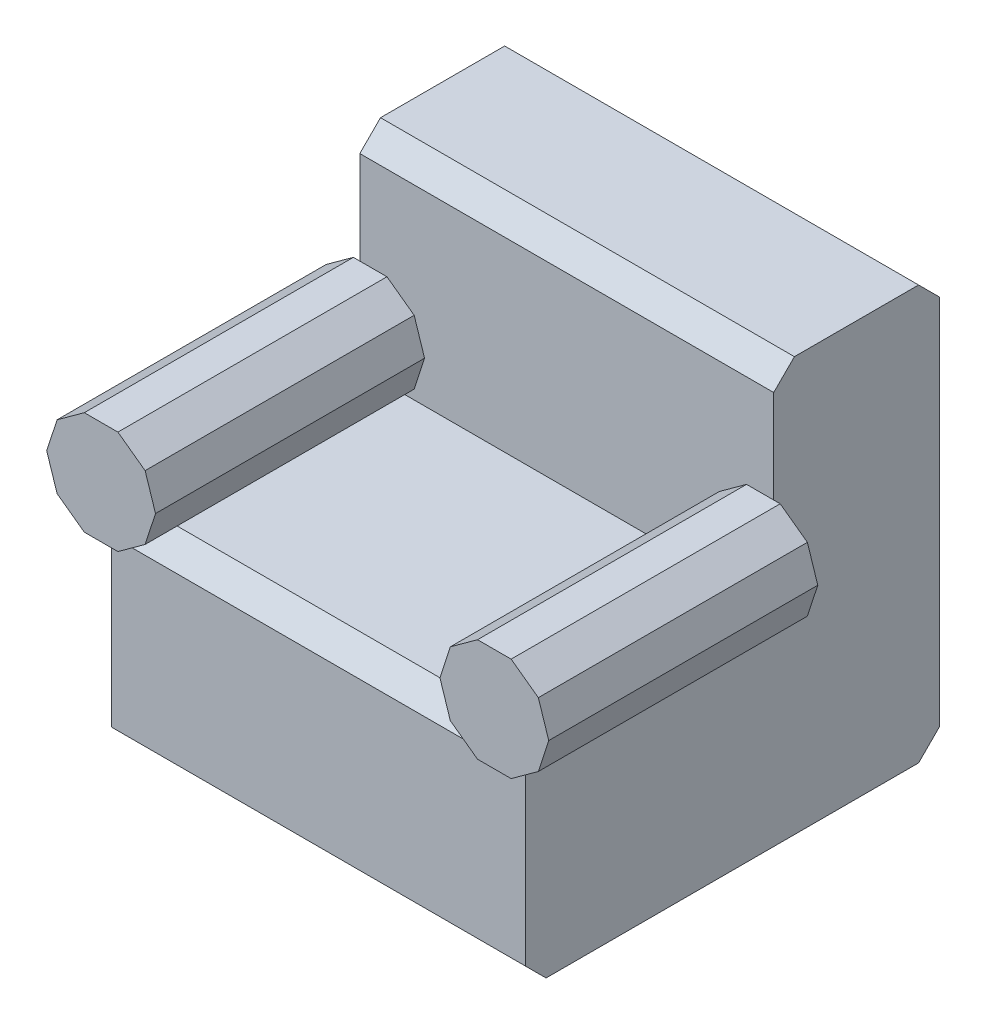
ISO-10303-21;
HEADER;
FILE_DESCRIPTION(('STEP AP214'),'2;1');
FILE_NAME('part.step','',(''),(''),'','','');
FILE_SCHEMA(('AUTOMOTIVE_DESIGN { 1 0 10303 214 1 1 1 1 }'));
ENDSEC;
DATA;
#1=APPLICATION_CONTEXT('core data for automotive mechanical design processes');
#2=APPLICATION_PROTOCOL_DEFINITION('international standard','automotive_design',2000,#1);
#3=PRODUCT_CONTEXT('',#1,'mechanical');
#4=PRODUCT('Part','Part','',(#3));
#5=PRODUCT_RELATED_PRODUCT_CATEGORY('part','',(#4));
#6=PRODUCT_DEFINITION_FORMATION('','',#4);
#7=PRODUCT_DEFINITION_CONTEXT('part definition',#1,'design');
#8=PRODUCT_DEFINITION('design','',#6,#7);
#9=PRODUCT_DEFINITION_SHAPE('','',#8);
#10=(LENGTH_UNIT() NAMED_UNIT(*) SI_UNIT(.MILLI.,.METRE.));
#11=(NAMED_UNIT(*) PLANE_ANGLE_UNIT() SI_UNIT($,.RADIAN.));
#12=(NAMED_UNIT(*) SI_UNIT($,.STERADIAN.) SOLID_ANGLE_UNIT());
#13=UNCERTAINTY_MEASURE_WITH_UNIT(LENGTH_MEASURE(1.E-05),#10,'distance_accuracy_value','');
#14=(GEOMETRIC_REPRESENTATION_CONTEXT(3) GLOBAL_UNCERTAINTY_ASSIGNED_CONTEXT((#13)) GLOBAL_UNIT_ASSIGNED_CONTEXT((#10,
#11,#12)) REPRESENTATION_CONTEXT('',''));
#15=CARTESIAN_POINT('',(0.,0.,0.));
#16=DIRECTION('',(0.,0.,1.));
#17=DIRECTION('',(1.,0.,0.));
#18=AXIS2_PLACEMENT_3D('',#15,#16,#17);
#19=CARTESIAN_POINT('',(50.,45.,0.));
#20=DIRECTION('',(0.,0.,-1.));
#21=DIRECTION('',(0.,1.,0.));
#22=AXIS2_PLACEMENT_3D('',#19,#20,#21);
#23=PLANE('',#22);
#24=DIRECTION('',(0.,-1.,0.));
#25=VECTOR('',#24,1.);
#26=CARTESIAN_POINT('',(-50.,45.,0.));
#27=LINE('',#26,#25);
#28=CARTESIAN_POINT('',(-50.,45.,0.));
#29=VERTEX_POINT('',#28);
#30=CARTESIAN_POINT('',(-50.,22.5,0.));
#31=VERTEX_POINT('',#30);
#32=EDGE_CURVE('E505',#29,#31,#27,.T.);
#33=ORIENTED_EDGE('',*,*,#32,.T.);
#34=DIRECTION('',(1.,0.,0.));
#35=VECTOR('',#34,1.);
#36=CARTESIAN_POINT('',(0.,22.4999999999999,0.));
#37=LINE('',#36,#35);
#38=CARTESIAN_POINT('',(-43.4385037970887,22.5,0.));
#39=VERTEX_POINT('',#38);
#40=EDGE_CURVE('E58',#31,#39,#37,.T.);
#41=ORIENTED_EDGE('',*,*,#40,.T.);
#42=DIRECTION('',(0.809016994374947,-0.587785252292474,0.));
#43=VECTOR('',#42,1.);
#44=CARTESIAN_POINT('',(-4.30824814846336,-5.92979486044836,0.));
#45=LINE('',#44,#43);
#46=CARTESIAN_POINT('',(-36.8668648955995,17.7254248593737,0.));
#47=VERTEX_POINT('',#46);
#48=EDGE_CURVE('E63',#39,#47,#45,.T.);
#49=ORIENTED_EDGE('',*,*,#48,.T.);
#50=DIRECTION('',(0.309016994374946,-0.951056516295154,0.));
#51=VECTOR('',#50,1.);
#52=CARTESIAN_POINT('',(-28.1370209012533,-9.1422722841341,0.));
#53=LINE('',#52,#51);
#54=CARTESIAN_POINT('',(-34.3567221970217,9.99999999999999,0.));
#55=VERTEX_POINT('',#54);
#56=EDGE_CURVE('E669',#47,#55,#53,.T.);
#57=ORIENTED_EDGE('',*,*,#56,.T.);
#58=DIRECTION('',(-0.309016994374949,-0.951056516295153,0.));
#59=VECTOR('',#58,1.);
#60=CARTESIAN_POINT('',(-34.0148734241779,11.0521023403847,0.));
#61=LINE('',#60,#59);
#62=CARTESIAN_POINT('',(-36.8668648955995,2.2745751406263,0.));
#63=VERTEX_POINT('',#62);
#64=EDGE_CURVE('E666',#55,#63,#61,.T.);
#65=ORIENTED_EDGE('',*,*,#64,.T.);
#66=DIRECTION('',(-0.809016994374948,-0.587785252292472,0.));
#67=VECTOR('',#66,1.);
#68=CARTESIAN_POINT('',(-13.8188133114148,19.0199648041978,0.));
#69=LINE('',#68,#67);
#70=CARTESIAN_POINT('',(-39.9975489959107,0.,0.));
#71=VERTEX_POINT('',#70);
#72=EDGE_CURVE('E304',#63,#71,#69,.T.);
#73=ORIENTED_EDGE('',*,*,#72,.T.);
#74=DIRECTION('',(-1.,0.,0.));
#75=VECTOR('',#74,1.);
#76=CARTESIAN_POINT('',(50.,0.,0.));
#77=LINE('',#76,#75);
#78=CARTESIAN_POINT('',(39.9975489959107,0.,0.));
#79=VERTEX_POINT('',#78);
#80=EDGE_CURVE('E574',#79,#71,#77,.T.);
#81=ORIENTED_EDGE('',*,*,#80,.F.);
#82=DIRECTION('',(0.809016994374948,-0.587785252292472,0.));
#83=VECTOR('',#82,1.);
#84=CARTESIAN_POINT('',(13.8188133114148,19.0199648041978,0.));
#85=LINE('',#84,#83);
#86=CARTESIAN_POINT('',(36.8668648955995,2.27457514062629,0.));
#87=VERTEX_POINT('',#86);
#88=EDGE_CURVE('E389',#87,#79,#85,.T.);
#89=ORIENTED_EDGE('',*,*,#88,.F.);
#90=DIRECTION('',(0.309016994374949,-0.951056516295153,0.));
#91=VECTOR('',#90,1.);
#92=CARTESIAN_POINT('',(34.0148734241779,11.0521023403847,0.));
#93=LINE('',#92,#91);
#94=CARTESIAN_POINT('',(34.3567221970217,9.99999999999999,0.));
#95=VERTEX_POINT('',#94);
#96=EDGE_CURVE('E347',#95,#87,#93,.T.);
#97=ORIENTED_EDGE('',*,*,#96,.F.);
#98=DIRECTION('',(-0.309016994374946,-0.951056516295154,0.));
#99=VECTOR('',#98,1.);
#100=CARTESIAN_POINT('',(28.1370209012533,-9.1422722841341,0.));
#101=LINE('',#100,#99);
#102=CARTESIAN_POINT('',(36.8668648955995,17.7254248593737,0.));
#103=VERTEX_POINT('',#102);
#104=EDGE_CURVE('E421',#103,#95,#101,.T.);
#105=ORIENTED_EDGE('',*,*,#104,.F.);
#106=DIRECTION('',(-0.809016994374947,-0.587785252292474,0.));
#107=VECTOR('',#106,1.);
#108=CARTESIAN_POINT('',(4.30824814846336,-5.92979486044836,0.));
#109=LINE('',#108,#107);
#110=CARTESIAN_POINT('',(43.4385037970887,22.5,0.));
#111=VERTEX_POINT('',#110);
#112=EDGE_CURVE('E417',#111,#103,#109,.T.);
#113=ORIENTED_EDGE('',*,*,#112,.F.);
#114=DIRECTION('',(-1.,0.,0.));
#115=VECTOR('',#114,1.);
#116=CARTESIAN_POINT('',(0.,22.4999999999999,0.));
#117=LINE('',#116,#115);
#118=CARTESIAN_POINT('',(50.,22.5,0.));
#119=VERTEX_POINT('',#118);
#120=EDGE_CURVE('E412',#119,#111,#117,.T.);
#121=ORIENTED_EDGE('',*,*,#120,.F.);
#122=DIRECTION('',(0.,-1.,0.));
#123=VECTOR('',#122,1.);
#124=CARTESIAN_POINT('',(50.,45.,0.));
#125=LINE('',#124,#123);
#126=CARTESIAN_POINT('',(50.,45.,0.));
#127=VERTEX_POINT('',#126);
#128=EDGE_CURVE('E472',#127,#119,#125,.T.);
#129=ORIENTED_EDGE('',*,*,#128,.F.);
#130=DIRECTION('',(-1.,0.,0.));
#131=VECTOR('',#130,1.);
#132=CARTESIAN_POINT('',(50.,45.,0.));
#133=LINE('',#132,#131);
#134=EDGE_CURVE('E504',#127,#29,#133,.T.);
#135=ORIENTED_EDGE('',*,*,#134,.T.);
#136=EDGE_LOOP('',(#33,#41,#49,#57,#65,#73,#81,#89,#97,#105,#113,#121,#129,#135));
#137=FACE_BOUND('',#136,.T.);
#138=ADVANCED_FACE('F43',(#137),#23,.F.);
#139=CARTESIAN_POINT('',(50.,0.,0.));
#140=DIRECTION('',(0.,-1.,0.));
#141=DIRECTION('',(0.,0.,-1.));
#142=AXIS2_PLACEMENT_3D('',#139,#140,#141);
#143=PLANE('',#142);
#144=ORIENTED_EDGE('',*,*,#80,.T.);
#145=DIRECTION('',(0.,0.,1.));
#146=VECTOR('',#145,1.);
#147=CARTESIAN_POINT('',(-39.9975489959107,0.,0.));
#148=LINE('',#147,#146);
#149=CARTESIAN_POINT('',(-39.9975489959107,0.,55.));
#150=VERTEX_POINT('',#149);
#151=EDGE_CURVE('E344',#71,#150,#148,.T.);
#152=ORIENTED_EDGE('',*,*,#151,.T.);
#153=DIRECTION('',(-1.,0.,0.));
#154=VECTOR('',#153,1.);
#155=CARTESIAN_POINT('',(50.,0.,55.));
#156=LINE('',#155,#154);
#157=CARTESIAN_POINT('',(39.9975489959107,0.,55.));
#158=VERTEX_POINT('',#157);
#159=EDGE_CURVE('E570',#158,#150,#156,.T.);
#160=ORIENTED_EDGE('',*,*,#159,.F.);
#161=DIRECTION('',(0.,0.,1.));
#162=VECTOR('',#161,1.);
#163=CARTESIAN_POINT('',(39.9975489959107,0.,0.));
#164=LINE('',#163,#162);
#165=EDGE_CURVE('E467',#79,#158,#164,.T.);
#166=ORIENTED_EDGE('',*,*,#165,.F.);
#167=EDGE_LOOP('',(#144,#152,#160,#166));
#168=FACE_BOUND('',#167,.T.);
#169=ADVANCED_FACE('F621',(#168),#143,.F.);
#170=CARTESIAN_POINT('',(50.,0.,55.));
#171=DIRECTION('',(0.,-0.707106781186547,-0.707106781186548));
#172=DIRECTION('',(0.,0.707106781186548,-0.707106781186547));
#173=AXIS2_PLACEMENT_3D('',#170,#171,#172);
#174=PLANE('',#173);
#175=DIRECTION('',(-0.697456562333056,-0.506731853971386,0.506731853971386));
#176=VECTOR('',#175,1.);
#177=CARTESIAN_POINT('',(3.78136779452633,31.8072448782604,23.1927551217396));
#178=LINE('',#177,#176);
#179=CARTESIAN_POINT('',(-43.4385037970887,-2.50000000000003,57.5));
#180=VERTEX_POINT('',#179);
#181=EDGE_CURVE('E12',#150,#180,#178,.T.);
#182=ORIENTED_EDGE('',*,*,#181,.T.);
#183=DIRECTION('',(-1.,0.,0.));
#184=VECTOR('',#183,1.);
#185=CARTESIAN_POINT('',(50.,-2.50000000000015,57.5000000000001));
#186=LINE('',#185,#184);
#187=CARTESIAN_POINT('',(-50.,-2.5,57.5));
#188=VERTEX_POINT('',#187);
#189=EDGE_CURVE('E340',#180,#188,#186,.T.);
#190=ORIENTED_EDGE('',*,*,#189,.T.);
#191=DIRECTION('',(0.,-0.707106781186548,0.707106781186547));
#192=VECTOR('',#191,1.);
#193=CARTESIAN_POINT('',(-50.,0.,55.));
#194=LINE('',#193,#192);
#195=CARTESIAN_POINT('',(-50.,-5.00000000000001,60.));
#196=VERTEX_POINT('',#195);
#197=EDGE_CURVE('E508',#188,#196,#194,.T.);
#198=ORIENTED_EDGE('',*,*,#197,.T.);
#199=DIRECTION('',(-1.,0.,0.));
#200=VECTOR('',#199,1.);
#201=CARTESIAN_POINT('',(50.,-5.00000000000001,60.));
#202=LINE('',#201,#200);
#203=CARTESIAN_POINT('',(50.,-5.00000000000001,60.));
#204=VERTEX_POINT('',#203);
#205=EDGE_CURVE('E566',#204,#196,#202,.T.);
#206=ORIENTED_EDGE('',*,*,#205,.F.);
#207=DIRECTION('',(0.,-0.707106781186548,0.707106781186547));
#208=VECTOR('',#207,1.);
#209=CARTESIAN_POINT('',(50.,0.,55.));
#210=LINE('',#209,#208);
#211=CARTESIAN_POINT('',(50.,-2.5,57.5));
#212=VERTEX_POINT('',#211);
#213=EDGE_CURVE('E476',#212,#204,#210,.T.);
#214=ORIENTED_EDGE('',*,*,#213,.F.);
#215=DIRECTION('',(1.,0.,0.));
#216=VECTOR('',#215,1.);
#217=CARTESIAN_POINT('',(50.,-2.5,57.5));
#218=LINE('',#217,#216);
#219=CARTESIAN_POINT('',(43.4385037970887,-2.50000000000001,57.5));
#220=VERTEX_POINT('',#219);
#221=EDGE_CURVE('E385',#220,#212,#218,.T.);
#222=ORIENTED_EDGE('',*,*,#221,.F.);
#223=DIRECTION('',(0.697456562333056,-0.506731853971386,0.506731853971386));
#224=VECTOR('',#223,1.);
#225=CARTESIAN_POINT('',(44.8631978396181,-3.53510081129349,58.5351008112935));
#226=LINE('',#225,#224);
#227=EDGE_CURVE('E582',#158,#220,#226,.T.);
#228=ORIENTED_EDGE('',*,*,#227,.F.);
#229=ORIENTED_EDGE('',*,*,#159,.T.);
#230=EDGE_LOOP('',(#182,#190,#198,#206,#214,#222,#228,#229));
#231=FACE_BOUND('',#230,.T.);
#232=ADVANCED_FACE('F601',(#231),#174,.F.);
#233=CARTESIAN_POINT('',(50.,0.,0.));
#234=DIRECTION('',(-1.,0.,0.));
#235=DIRECTION('',(0.,0.,1.));
#236=AXIS2_PLACEMENT_3D('',#233,#234,#235);
#237=PLANE('',#236);
#238=CARTESIAN_POINT('',(50.,-2.5,0.));
#239=VERTEX_POINT('',#238);
#240=EDGE_CURVE('E477',#119,#239,#125,.T.);
#241=ORIENTED_EDGE('',*,*,#240,.T.);
#242=DIRECTION('',(0.,0.,-1.));
#243=VECTOR('',#242,1.);
#244=CARTESIAN_POINT('',(50.,-2.5,0.));
#245=LINE('',#244,#243);
#246=EDGE_CURVE('E578',#212,#239,#245,.T.);
#247=ORIENTED_EDGE('',*,*,#246,.F.);
#248=ORIENTED_EDGE('',*,*,#213,.T.);
#249=DIRECTION('',(0.,-1.,0.));
#250=VECTOR('',#249,1.);
#251=CARTESIAN_POINT('',(50.,-5.00000000000001,60.));
#252=LINE('',#251,#250);
#253=CARTESIAN_POINT('',(50.,-45.,60.));
#254=VERTEX_POINT('',#253);
#255=EDGE_CURVE('E480',#204,#254,#252,.T.);
#256=ORIENTED_EDGE('',*,*,#255,.T.);
#257=DIRECTION('',(0.,-0.707106781186547,-0.707106781186547));
#258=VECTOR('',#257,1.);
#259=CARTESIAN_POINT('',(50.,-45.,60.));
#260=LINE('',#259,#258);
#261=CARTESIAN_POINT('',(50.,-50.,55.));
#262=VERTEX_POINT('',#261);
#263=EDGE_CURVE('E483',#254,#262,#260,.T.);
#264=ORIENTED_EDGE('',*,*,#263,.T.);
#265=DIRECTION('',(0.,0.,-1.));
#266=VECTOR('',#265,1.);
#267=CARTESIAN_POINT('',(50.,-50.,55.));
#268=LINE('',#267,#266);
#269=CARTESIAN_POINT('',(50.,-50.,-35.));
#270=VERTEX_POINT('',#269);
#271=EDGE_CURVE('E486',#262,#270,#268,.T.);
#272=ORIENTED_EDGE('',*,*,#271,.T.);
#273=DIRECTION('',(0.,0.707106781186547,-0.707106781186547));
#274=VECTOR('',#273,1.);
#275=CARTESIAN_POINT('',(50.,-50.,-35.));
#276=LINE('',#275,#274);
#277=CARTESIAN_POINT('',(50.,-45.,-40.));
#278=VERTEX_POINT('',#277);
#279=EDGE_CURVE('E489',#270,#278,#276,.T.);
#280=ORIENTED_EDGE('',*,*,#279,.T.);
#281=DIRECTION('',(0.,1.,0.));
#282=VECTOR('',#281,1.);
#283=CARTESIAN_POINT('',(50.,-45.,-40.));
#284=LINE('',#283,#282);
#285=CARTESIAN_POINT('',(50.,45.,-40.));
#286=VERTEX_POINT('',#285);
#287=EDGE_CURVE('E492',#278,#286,#284,.T.);
#288=ORIENTED_EDGE('',*,*,#287,.T.);
#289=DIRECTION('',(0.,0.707106781186546,0.707106781186549));
#290=VECTOR('',#289,1.);
#291=CARTESIAN_POINT('',(50.,45.,-40.));
#292=LINE('',#291,#290);
#293=CARTESIAN_POINT('',(50.,50.,-35.));
#294=VERTEX_POINT('',#293);
#295=EDGE_CURVE('E495',#286,#294,#292,.T.);
#296=ORIENTED_EDGE('',*,*,#295,.T.);
#297=DIRECTION('',(0.,0.,1.));
#298=VECTOR('',#297,1.);
#299=CARTESIAN_POINT('',(50.,50.,-35.));
#300=LINE('',#299,#298);
#301=CARTESIAN_POINT('',(50.,50.,-5.));
#302=VERTEX_POINT('',#301);
#303=EDGE_CURVE('E498',#294,#302,#300,.T.);
#304=ORIENTED_EDGE('',*,*,#303,.T.);
#305=DIRECTION('',(0.,-0.707106781186547,0.707106781186548));
#306=VECTOR('',#305,1.);
#307=CARTESIAN_POINT('',(50.,50.,-5.));
#308=LINE('',#307,#306);
#309=EDGE_CURVE('E501',#302,#127,#308,.T.);
#310=ORIENTED_EDGE('',*,*,#309,.T.);
#311=ORIENTED_EDGE('',*,*,#128,.T.);
#312=EDGE_LOOP('',(#241,#247,#248,#256,#264,#272,#280,#288,#296,#304,#310,#311));
#313=FACE_BOUND('',#312,.T.);
#314=ADVANCED_FACE('F609',(#313),#237,.F.);
#315=CARTESIAN_POINT('',(50.,-5.00000000000001,60.));
#316=DIRECTION('',(0.,0.,-1.));
#317=DIRECTION('',(0.,1.,0.));
#318=AXIS2_PLACEMENT_3D('',#315,#316,#317);
#319=PLANE('',#318);
#320=DIRECTION('',(0.,-1.,0.));
#321=VECTOR('',#320,1.);
#322=CARTESIAN_POINT('',(-50.,-5.00000000000001,60.));
#323=LINE('',#322,#321);
#324=CARTESIAN_POINT('',(-50.,-45.,60.));
#325=VERTEX_POINT('',#324);
#326=EDGE_CURVE('E511',#196,#325,#323,.T.);
#327=ORIENTED_EDGE('',*,*,#326,.T.);
#328=DIRECTION('',(-1.,0.,0.));
#329=VECTOR('',#328,1.);
#330=CARTESIAN_POINT('',(50.,-45.,60.));
#331=LINE('',#330,#329);
#332=EDGE_CURVE('E562',#254,#325,#331,.T.);
#333=ORIENTED_EDGE('',*,*,#332,.F.);
#334=ORIENTED_EDGE('',*,*,#255,.F.);
#335=ORIENTED_EDGE('',*,*,#205,.T.);
#336=EDGE_LOOP('',(#327,#333,#334,#335));
#337=FACE_BOUND('',#336,.T.);
#338=ADVANCED_FACE('F605',(#337),#319,.F.);
#339=CARTESIAN_POINT('',(50.,-45.,60.));
#340=DIRECTION('',(0.,0.707106781186547,-0.707106781186547));
#341=DIRECTION('',(0.,0.707106781186548,0.707106781186548));
#342=AXIS2_PLACEMENT_3D('',#339,#340,#341);
#343=PLANE('',#342);
#344=DIRECTION('',(0.,-0.707106781186547,-0.707106781186547));
#345=VECTOR('',#344,1.);
#346=CARTESIAN_POINT('',(-50.,-45.,60.));
#347=LINE('',#346,#345);
#348=CARTESIAN_POINT('',(-50.,-50.,55.));
#349=VERTEX_POINT('',#348);
#350=EDGE_CURVE('E514',#325,#349,#347,.T.);
#351=ORIENTED_EDGE('',*,*,#350,.T.);
#352=DIRECTION('',(-1.,0.,0.));
#353=VECTOR('',#352,1.);
#354=CARTESIAN_POINT('',(50.,-50.,55.));
#355=LINE('',#354,#353);
#356=EDGE_CURVE('E558',#262,#349,#355,.T.);
#357=ORIENTED_EDGE('',*,*,#356,.F.);
#358=ORIENTED_EDGE('',*,*,#263,.F.);
#359=ORIENTED_EDGE('',*,*,#332,.T.);
#360=EDGE_LOOP('',(#351,#357,#358,#359));
#361=FACE_BOUND('',#360,.T.);
#362=ADVANCED_FACE('F714',(#361),#343,.F.);
#363=CARTESIAN_POINT('',(50.,-50.,55.));
#364=DIRECTION('',(0.,1.,0.));
#365=DIRECTION('',(0.,0.,1.));
#366=AXIS2_PLACEMENT_3D('',#363,#364,#365);
#367=PLANE('',#366);
#368=DIRECTION('',(0.,0.,-1.));
#369=VECTOR('',#368,1.);
#370=CARTESIAN_POINT('',(-50.,-50.,55.));
#371=LINE('',#370,#369);
#372=CARTESIAN_POINT('',(-50.,-50.,-35.));
#373=VERTEX_POINT('',#372);
#374=EDGE_CURVE('E517',#349,#373,#371,.T.);
#375=ORIENTED_EDGE('',*,*,#374,.T.);
#376=DIRECTION('',(-1.,0.,0.));
#377=VECTOR('',#376,1.);
#378=CARTESIAN_POINT('',(50.,-50.,-35.));
#379=LINE('',#378,#377);
#380=EDGE_CURVE('E554',#270,#373,#379,.T.);
#381=ORIENTED_EDGE('',*,*,#380,.F.);
#382=ORIENTED_EDGE('',*,*,#271,.F.);
#383=ORIENTED_EDGE('',*,*,#356,.T.);
#384=EDGE_LOOP('',(#375,#381,#382,#383));
#385=FACE_BOUND('',#384,.T.);
#386=ADVANCED_FACE('F717',(#385),#367,.F.);
#387=CARTESIAN_POINT('',(50.,-50.,-35.));
#388=DIRECTION('',(0.,0.707106781186547,0.707106781186547));
#389=DIRECTION('',(0.,-0.707106781186548,0.707106781186548));
#390=AXIS2_PLACEMENT_3D('',#387,#388,#389);
#391=PLANE('',#390);
#392=DIRECTION('',(0.,0.707106781186547,-0.707106781186547));
#393=VECTOR('',#392,1.);
#394=CARTESIAN_POINT('',(-50.,-50.,-35.));
#395=LINE('',#394,#393);
#396=CARTESIAN_POINT('',(-50.,-45.,-40.));
#397=VERTEX_POINT('',#396);
#398=EDGE_CURVE('E520',#373,#397,#395,.T.);
#399=ORIENTED_EDGE('',*,*,#398,.T.);
#400=DIRECTION('',(-1.,0.,0.));
#401=VECTOR('',#400,1.);
#402=CARTESIAN_POINT('',(50.,-45.,-40.));
#403=LINE('',#402,#401);
#404=EDGE_CURVE('E550',#278,#397,#403,.T.);
#405=ORIENTED_EDGE('',*,*,#404,.F.);
#406=ORIENTED_EDGE('',*,*,#279,.F.);
#407=ORIENTED_EDGE('',*,*,#380,.T.);
#408=EDGE_LOOP('',(#399,#405,#406,#407));
#409=FACE_BOUND('',#408,.T.);
#410=ADVANCED_FACE('F721',(#409),#391,.F.);
#411=CARTESIAN_POINT('',(50.,-45.,-40.));
#412=DIRECTION('',(0.,0.,1.));
#413=DIRECTION('',(0.,-1.,0.));
#414=AXIS2_PLACEMENT_3D('',#411,#412,#413);
#415=PLANE('',#414);
#416=DIRECTION('',(0.,1.,0.));
#417=VECTOR('',#416,1.);
#418=CARTESIAN_POINT('',(-50.,-45.,-40.));
#419=LINE('',#418,#417);
#420=CARTESIAN_POINT('',(-50.,45.,-40.));
#421=VERTEX_POINT('',#420);
#422=EDGE_CURVE('E523',#397,#421,#419,.T.);
#423=ORIENTED_EDGE('',*,*,#422,.T.);
#424=DIRECTION('',(-1.,0.,0.));
#425=VECTOR('',#424,1.);
#426=CARTESIAN_POINT('',(50.,45.,-40.));
#427=LINE('',#426,#425);
#428=EDGE_CURVE('E546',#286,#421,#427,.T.);
#429=ORIENTED_EDGE('',*,*,#428,.F.);
#430=ORIENTED_EDGE('',*,*,#287,.F.);
#431=ORIENTED_EDGE('',*,*,#404,.T.);
#432=EDGE_LOOP('',(#423,#429,#430,#431));
#433=FACE_BOUND('',#432,.T.);
#434=ADVANCED_FACE('F725',(#433),#415,.F.);
#435=CARTESIAN_POINT('',(50.,45.,-40.));
#436=DIRECTION('',(0.,-0.707106781186549,0.707106781186546));
#437=DIRECTION('',(0.,-0.707106781186546,-0.707106781186549));
#438=AXIS2_PLACEMENT_3D('',#435,#436,#437);
#439=PLANE('',#438);
#440=DIRECTION('',(0.,0.707106781186546,0.707106781186549));
#441=VECTOR('',#440,1.);
#442=CARTESIAN_POINT('',(-50.,45.,-40.));
#443=LINE('',#442,#441);
#444=CARTESIAN_POINT('',(-50.,50.,-35.));
#445=VERTEX_POINT('',#444);
#446=EDGE_CURVE('E526',#421,#445,#443,.T.);
#447=ORIENTED_EDGE('',*,*,#446,.T.);
#448=DIRECTION('',(-1.,0.,0.));
#449=VECTOR('',#448,1.);
#450=CARTESIAN_POINT('',(50.,50.,-35.));
#451=LINE('',#450,#449);
#452=EDGE_CURVE('E542',#294,#445,#451,.T.);
#453=ORIENTED_EDGE('',*,*,#452,.F.);
#454=ORIENTED_EDGE('',*,*,#295,.F.);
#455=ORIENTED_EDGE('',*,*,#428,.T.);
#456=EDGE_LOOP('',(#447,#453,#454,#455));
#457=FACE_BOUND('',#456,.T.);
#458=ADVANCED_FACE('F729',(#457),#439,.F.);
#459=CARTESIAN_POINT('',(50.,50.,-35.));
#460=DIRECTION('',(0.,-1.,0.));
#461=DIRECTION('',(0.,0.,-1.));
#462=AXIS2_PLACEMENT_3D('',#459,#460,#461);
#463=PLANE('',#462);
#464=DIRECTION('',(0.,0.,1.));
#465=VECTOR('',#464,1.);
#466=CARTESIAN_POINT('',(-50.,50.,-35.));
#467=LINE('',#466,#465);
#468=CARTESIAN_POINT('',(-50.,50.,-5.));
#469=VERTEX_POINT('',#468);
#470=EDGE_CURVE('E529',#445,#469,#467,.T.);
#471=ORIENTED_EDGE('',*,*,#470,.T.);
#472=DIRECTION('',(-1.,0.,0.));
#473=VECTOR('',#472,1.);
#474=CARTESIAN_POINT('',(50.,50.,-5.));
#475=LINE('',#474,#473);
#476=EDGE_CURVE('E538',#302,#469,#475,.T.);
#477=ORIENTED_EDGE('',*,*,#476,.F.);
#478=ORIENTED_EDGE('',*,*,#303,.F.);
#479=ORIENTED_EDGE('',*,*,#452,.T.);
#480=EDGE_LOOP('',(#471,#477,#478,#479));
#481=FACE_BOUND('',#480,.T.);
#482=ADVANCED_FACE('F733',(#481),#463,.F.);
#483=CARTESIAN_POINT('',(50.,50.,-5.));
#484=DIRECTION('',(0.,-0.707106781186548,-0.707106781186547));
#485=DIRECTION('',(0.,0.707106781186547,-0.707106781186548));
#486=AXIS2_PLACEMENT_3D('',#483,#484,#485);
#487=PLANE('',#486);
#488=DIRECTION('',(0.,-0.707106781186547,0.707106781186548));
#489=VECTOR('',#488,1.);
#490=CARTESIAN_POINT('',(-50.,50.,-5.));
#491=LINE('',#490,#489);
#492=EDGE_CURVE('E532',#469,#29,#491,.T.);
#493=ORIENTED_EDGE('',*,*,#492,.T.);
#494=ORIENTED_EDGE('',*,*,#134,.F.);
#495=ORIENTED_EDGE('',*,*,#309,.F.);
#496=ORIENTED_EDGE('',*,*,#476,.T.);
#497=EDGE_LOOP('',(#493,#494,#495,#496));
#498=FACE_BOUND('',#497,.T.);
#499=ADVANCED_FACE('F737',(#498),#487,.F.);
#500=CARTESIAN_POINT('',(-50.,0.,0.));
#501=DIRECTION('',(-1.,0.,0.));
#502=DIRECTION('',(0.,0.,1.));
#503=AXIS2_PLACEMENT_3D('',#500,#501,#502);
#504=PLANE('',#503);
#505=DIRECTION('',(0.,0.,1.));
#506=VECTOR('',#505,1.);
#507=CARTESIAN_POINT('',(-50.,-2.5,0.));
#508=LINE('',#507,#506);
#509=CARTESIAN_POINT('',(-50.,-2.50000000000001,0.));
#510=VERTEX_POINT('',#509);
#511=EDGE_CURVE('E51',#510,#188,#508,.T.);
#512=ORIENTED_EDGE('',*,*,#511,.F.);
#513=EDGE_CURVE('E471',#31,#510,#27,.T.);
#514=ORIENTED_EDGE('',*,*,#513,.F.);
#515=ORIENTED_EDGE('',*,*,#32,.F.);
#516=ORIENTED_EDGE('',*,*,#492,.F.);
#517=ORIENTED_EDGE('',*,*,#470,.F.);
#518=ORIENTED_EDGE('',*,*,#446,.F.);
#519=ORIENTED_EDGE('',*,*,#422,.F.);
#520=ORIENTED_EDGE('',*,*,#398,.F.);
#521=ORIENTED_EDGE('',*,*,#374,.F.);
#522=ORIENTED_EDGE('',*,*,#350,.F.);
#523=ORIENTED_EDGE('',*,*,#326,.F.);
#524=ORIENTED_EDGE('',*,*,#197,.F.);
#525=EDGE_LOOP('',(#512,#514,#515,#516,#517,#518,#519,#520,#521,#522,#523,#524));
#526=FACE_BOUND('',#525,.T.);
#527=ADVANCED_FACE('F595',(#526),#504,.T.);
#528=CARTESIAN_POINT('',(13.8188133114148,19.0199648041978,106.276480061123));
#529=DIRECTION('',(0.587785252292472,0.809016994374948,0.));
#530=DIRECTION('',(-0.809016994374948,0.587785252292472,0.));
#531=AXIS2_PLACEMENT_3D('',#528,#529,#530);
#532=PLANE('',#531);
#533=ORIENTED_EDGE('',*,*,#88,.T.);
#534=ORIENTED_EDGE('',*,*,#165,.T.);
#535=ORIENTED_EDGE('',*,*,#227,.T.);
#536=DIRECTION('',(0.,0.,-1.));
#537=VECTOR('',#536,1.);
#538=CARTESIAN_POINT('',(43.4385037970887,-2.50000000000001,106.276480061123));
#539=LINE('',#538,#537);
#540=CARTESIAN_POINT('',(43.4385037970887,-2.50000000000001,65.));
#541=VERTEX_POINT('',#540);
#542=EDGE_CURVE('E453',#541,#220,#539,.T.);
#543=ORIENTED_EDGE('',*,*,#542,.F.);
#544=DIRECTION('',(-0.809016994374948,0.587785252292472,0.));
#545=VECTOR('',#544,1.);
#546=CARTESIAN_POINT('',(13.8188133114148,19.0199648041978,65.));
#547=LINE('',#546,#545);
#548=CARTESIAN_POINT('',(36.8668648955995,2.27457514062629,65.));
#549=VERTEX_POINT('',#548);
#550=EDGE_CURVE('E377',#541,#549,#547,.T.);
#551=ORIENTED_EDGE('',*,*,#550,.T.);
#552=DIRECTION('',(0.,0.,-1.));
#553=VECTOR('',#552,1.);
#554=CARTESIAN_POINT('',(36.8668648955995,2.27457514062629,106.276480061123));
#555=LINE('',#554,#553);
#556=EDGE_CURVE('E457',#549,#87,#555,.T.);
#557=ORIENTED_EDGE('',*,*,#556,.T.);
#558=EDGE_LOOP('',(#533,#534,#535,#543,#551,#557));
#559=FACE_BOUND('',#558,.T.);
#560=ADVANCED_FACE('F617',(#559),#532,.F.);
#561=CARTESIAN_POINT('',(0.,0.,0.));
#562=DIRECTION('',(0.,0.,1.));
#563=DIRECTION('',(1.,0.,0.));
#564=AXIS2_PLACEMENT_3D('',#561,#562,#563);
#565=PLANE('',#564);
#566=DIRECTION('',(1.,0.,0.));
#567=VECTOR('',#566,1.);
#568=CARTESIAN_POINT('',(0.,-2.50000000000008,0.));
#569=LINE('',#568,#567);
#570=CARTESIAN_POINT('',(51.5614962029113,-2.5,0.));
#571=VERTEX_POINT('',#570);
#572=EDGE_CURVE('E393',#239,#571,#569,.T.);
#573=ORIENTED_EDGE('',*,*,#572,.F.);
#574=ORIENTED_EDGE('',*,*,#240,.F.);
#575=CARTESIAN_POINT('',(51.5614962029113,22.5,0.));
#576=VERTEX_POINT('',#575);
#577=EDGE_CURVE('E413',#576,#119,#117,.T.);
#578=ORIENTED_EDGE('',*,*,#577,.F.);
#579=DIRECTION('',(-0.809016994374948,0.587785252292472,0.));
#580=VECTOR('',#579,1.);
#581=CARTESIAN_POINT('',(28.5134446187266,39.2453896635715,0.));
#582=LINE('',#581,#580);
#583=CARTESIAN_POINT('',(58.1331351044005,17.7254248593737,0.));
#584=VERTEX_POINT('',#583);
#585=EDGE_CURVE('E408',#584,#576,#582,.T.);
#586=ORIENTED_EDGE('',*,*,#585,.F.);
#587=DIRECTION('',(-0.309016994374948,0.951056516295154,0.));
#588=VECTOR('',#587,1.);
#589=CARTESIAN_POINT('',(57.7912863315568,18.7775271997584,0.));
#590=LINE('',#589,#588);
#591=CARTESIAN_POINT('',(60.6432778029783,10.,0.));
#592=VERTEX_POINT('',#591);
#593=EDGE_CURVE('E404',#592,#584,#590,.T.);
#594=ORIENTED_EDGE('',*,*,#593,.F.);
#595=DIRECTION('',(0.309016994374945,0.951056516295155,0.));
#596=VECTOR('',#595,1.);
#597=CARTESIAN_POINT('',(51.9134338086322,-16.8676971435077,0.));
#598=LINE('',#597,#596);
#599=CARTESIAN_POINT('',(58.1331351044005,2.27457514062632,0.));
#600=VERTEX_POINT('',#599);
#601=EDGE_CURVE('E400',#600,#592,#598,.T.);
#602=ORIENTED_EDGE('',*,*,#601,.F.);
#603=DIRECTION('',(0.809016994374947,0.587785252292474,0.));
#604=VECTOR('',#603,1.);
#605=CARTESIAN_POINT('',(19.0028794557752,-26.155219719822,0.));
#606=LINE('',#605,#604);
#607=EDGE_CURVE('E396',#571,#600,#606,.T.);
#608=ORIENTED_EDGE('',*,*,#607,.F.);
#609=EDGE_LOOP('',(#573,#574,#578,#586,#594,#602,#608));
#610=FACE_BOUND('',#609,.T.);
#611=ADVANCED_FACE('F754',(#610),#565,.F.);
#612=CARTESIAN_POINT('',(0.,-2.50000000000008,106.276480061123));
#613=DIRECTION('',(0.,1.,0.));
#614=DIRECTION('',(-1.,0.,0.));
#615=AXIS2_PLACEMENT_3D('',#612,#613,#614);
#616=PLANE('',#615);
#617=ORIENTED_EDGE('',*,*,#542,.T.);
#618=ORIENTED_EDGE('',*,*,#221,.T.);
#619=ORIENTED_EDGE('',*,*,#246,.T.);
#620=ORIENTED_EDGE('',*,*,#572,.T.);
#621=DIRECTION('',(0.,0.,-1.));
#622=VECTOR('',#621,1.);
#623=CARTESIAN_POINT('',(51.5614962029113,-2.5,106.276480061123));
#624=LINE('',#623,#622);
#625=CARTESIAN_POINT('',(51.5614962029113,-2.5,65.));
#626=VERTEX_POINT('',#625);
#627=EDGE_CURVE('E449',#626,#571,#624,.T.);
#628=ORIENTED_EDGE('',*,*,#627,.F.);
#629=DIRECTION('',(-1.,0.,0.));
#630=VECTOR('',#629,1.);
#631=CARTESIAN_POINT('',(0.,-2.50000000000008,65.));
#632=LINE('',#631,#630);
#633=EDGE_CURVE('E373',#626,#541,#632,.T.);
#634=ORIENTED_EDGE('',*,*,#633,.T.);
#635=EDGE_LOOP('',(#617,#618,#619,#620,#628,#634));
#636=FACE_BOUND('',#635,.T.);
#637=ADVANCED_FACE('F612',(#636),#616,.F.);
#638=CARTESIAN_POINT('',(28.1370209012533,-9.1422722841341,106.276480061123));
#639=DIRECTION('',(0.951056516295154,-0.309016994374946,0.));
#640=DIRECTION('',(0.309016994374946,0.951056516295154,0.));
#641=AXIS2_PLACEMENT_3D('',#638,#639,#640);
#642=PLANE('',#641);
#643=DIRECTION('',(0.,0.,-1.));
#644=VECTOR('',#643,1.);
#645=CARTESIAN_POINT('',(34.3567221970217,9.99999999999999,106.276480061123));
#646=LINE('',#645,#644);
#647=CARTESIAN_POINT('',(34.3567221970217,9.99999999999998,65.));
#648=VERTEX_POINT('',#647);
#649=EDGE_CURVE('E425',#648,#95,#646,.T.);
#650=ORIENTED_EDGE('',*,*,#649,.F.);
#651=DIRECTION('',(0.309016994374946,0.951056516295154,0.));
#652=VECTOR('',#651,1.);
#653=CARTESIAN_POINT('',(28.1370209012533,-9.14227228413409,65.));
#654=LINE('',#653,#652);
#655=CARTESIAN_POINT('',(36.8668648955995,17.7254248593737,65.));
#656=VERTEX_POINT('',#655);
#657=EDGE_CURVE('E353',#648,#656,#654,.T.);
#658=ORIENTED_EDGE('',*,*,#657,.T.);
#659=DIRECTION('',(0.,0.,-1.));
#660=VECTOR('',#659,1.);
#661=CARTESIAN_POINT('',(36.8668648955995,17.7254248593737,106.276480061123));
#662=LINE('',#661,#660);
#663=EDGE_CURVE('E429',#656,#103,#662,.T.);
#664=ORIENTED_EDGE('',*,*,#663,.T.);
#665=ORIENTED_EDGE('',*,*,#104,.T.);
#666=EDGE_LOOP('',(#650,#658,#664,#665));
#667=FACE_BOUND('',#666,.T.);
#668=ADVANCED_FACE('F757',(#667),#642,.F.);
#669=CARTESIAN_POINT('',(4.30824814846336,-5.92979486044836,106.276480061123));
#670=DIRECTION('',(0.587785252292474,-0.809016994374947,0.));
#671=DIRECTION('',(0.809016994374947,0.587785252292474,0.));
#672=AXIS2_PLACEMENT_3D('',#669,#670,#671);
#673=PLANE('',#672);
#674=ORIENTED_EDGE('',*,*,#663,.F.);
#675=DIRECTION('',(0.809016994374947,0.587785252292474,0.));
#676=VECTOR('',#675,1.);
#677=CARTESIAN_POINT('',(4.30824814846336,-5.92979486044836,65.));
#678=LINE('',#677,#676);
#679=CARTESIAN_POINT('',(43.4385037970887,22.5,65.));
#680=VERTEX_POINT('',#679);
#681=EDGE_CURVE('E348',#656,#680,#678,.T.);
#682=ORIENTED_EDGE('',*,*,#681,.T.);
#683=DIRECTION('',(0.,0.,-1.));
#684=VECTOR('',#683,1.);
#685=CARTESIAN_POINT('',(43.4385037970887,22.5,106.276480061123));
#686=LINE('',#685,#684);
#687=EDGE_CURVE('E433',#680,#111,#686,.T.);
#688=ORIENTED_EDGE('',*,*,#687,.T.);
#689=ORIENTED_EDGE('',*,*,#112,.T.);
#690=EDGE_LOOP('',(#674,#682,#688,#689));
#691=FACE_BOUND('',#690,.T.);
#692=ADVANCED_FACE('F776',(#691),#673,.F.);
#693=CARTESIAN_POINT('',(0.,22.4999999999999,106.276480061123));
#694=DIRECTION('',(0.,-1.,0.));
#695=DIRECTION('',(1.,0.,0.));
#696=AXIS2_PLACEMENT_3D('',#693,#694,#695);
#697=PLANE('',#696);
#698=ORIENTED_EDGE('',*,*,#687,.F.);
#699=DIRECTION('',(1.,0.,0.));
#700=VECTOR('',#699,1.);
#701=CARTESIAN_POINT('',(0.,22.4999999999999,65.));
#702=LINE('',#701,#700);
#703=CARTESIAN_POINT('',(51.5614962029113,22.5,65.));
#704=VERTEX_POINT('',#703);
#705=EDGE_CURVE('E352',#680,#704,#702,.T.);
#706=ORIENTED_EDGE('',*,*,#705,.T.);
#707=DIRECTION('',(0.,0.,-1.));
#708=VECTOR('',#707,1.);
#709=CARTESIAN_POINT('',(51.5614962029113,22.5,106.276480061123));
#710=LINE('',#709,#708);
#711=EDGE_CURVE('E437',#704,#576,#710,.T.);
#712=ORIENTED_EDGE('',*,*,#711,.T.);
#713=ORIENTED_EDGE('',*,*,#577,.T.);
#714=ORIENTED_EDGE('',*,*,#120,.T.);
#715=EDGE_LOOP('',(#698,#706,#712,#713,#714));
#716=FACE_BOUND('',#715,.T.);
#717=ADVANCED_FACE('F772',(#716),#697,.F.);
#718=CARTESIAN_POINT('',(28.5134446187266,39.2453896635715,106.276480061123));
#719=DIRECTION('',(-0.587785252292472,-0.809016994374948,0.));
#720=DIRECTION('',(0.809016994374948,-0.587785252292472,0.));
#721=AXIS2_PLACEMENT_3D('',#718,#719,#720);
#722=PLANE('',#721);
#723=ORIENTED_EDGE('',*,*,#711,.F.);
#724=DIRECTION('',(0.809016994374948,-0.587785252292472,0.));
#725=VECTOR('',#724,1.);
#726=CARTESIAN_POINT('',(28.5134446187266,39.2453896635715,65.));
#727=LINE('',#726,#725);
#728=CARTESIAN_POINT('',(58.1331351044005,17.7254248593737,65.));
#729=VERTEX_POINT('',#728);
#730=EDGE_CURVE('E357',#704,#729,#727,.T.);
#731=ORIENTED_EDGE('',*,*,#730,.T.);
#732=DIRECTION('',(0.,0.,-1.));
#733=VECTOR('',#732,1.);
#734=CARTESIAN_POINT('',(58.1331351044005,17.7254248593737,106.276480061123));
#735=LINE('',#734,#733);
#736=EDGE_CURVE('E440',#729,#584,#735,.T.);
#737=ORIENTED_EDGE('',*,*,#736,.T.);
#738=ORIENTED_EDGE('',*,*,#585,.T.);
#739=EDGE_LOOP('',(#723,#731,#737,#738));
#740=FACE_BOUND('',#739,.T.);
#741=ADVANCED_FACE('F768',(#740),#722,.F.);
#742=CARTESIAN_POINT('',(57.7912863315568,18.7775271997584,106.276480061123));
#743=DIRECTION('',(-0.951056516295154,-0.309016994374948,0.));
#744=DIRECTION('',(0.309016994374948,-0.951056516295154,0.));
#745=AXIS2_PLACEMENT_3D('',#742,#743,#744);
#746=PLANE('',#745);
#747=ORIENTED_EDGE('',*,*,#736,.F.);
#748=DIRECTION('',(0.309016994374948,-0.951056516295154,0.));
#749=VECTOR('',#748,1.);
#750=CARTESIAN_POINT('',(57.7912863315568,18.7775271997584,65.));
#751=LINE('',#750,#749);
#752=CARTESIAN_POINT('',(60.6432778029783,10.,65.));
#753=VERTEX_POINT('',#752);
#754=EDGE_CURVE('E361',#729,#753,#751,.T.);
#755=ORIENTED_EDGE('',*,*,#754,.T.);
#756=DIRECTION('',(0.,0.,-1.));
#757=VECTOR('',#756,1.);
#758=CARTESIAN_POINT('',(60.6432778029783,10.,106.276480061123));
#759=LINE('',#758,#757);
#760=EDGE_CURVE('E443',#753,#592,#759,.T.);
#761=ORIENTED_EDGE('',*,*,#760,.T.);
#762=ORIENTED_EDGE('',*,*,#593,.T.);
#763=EDGE_LOOP('',(#747,#755,#761,#762));
#764=FACE_BOUND('',#763,.T.);
#765=ADVANCED_FACE('F764',(#764),#746,.F.);
#766=CARTESIAN_POINT('',(51.9134338086322,-16.8676971435077,106.276480061123));
#767=DIRECTION('',(-0.951056516295154,0.309016994374945,0.));
#768=DIRECTION('',(-0.309016994374945,-0.951056516295155,0.));
#769=AXIS2_PLACEMENT_3D('',#766,#767,#768);
#770=PLANE('',#769);
#771=ORIENTED_EDGE('',*,*,#760,.F.);
#772=DIRECTION('',(-0.309016994374945,-0.951056516295155,0.));
#773=VECTOR('',#772,1.);
#774=CARTESIAN_POINT('',(51.9134338086322,-16.8676971435077,65.));
#775=LINE('',#774,#773);
#776=CARTESIAN_POINT('',(58.1331351044005,2.27457514062632,65.));
#777=VERTEX_POINT('',#776);
#778=EDGE_CURVE('E365',#753,#777,#775,.T.);
#779=ORIENTED_EDGE('',*,*,#778,.T.);
#780=DIRECTION('',(0.,0.,-1.));
#781=VECTOR('',#780,1.);
#782=CARTESIAN_POINT('',(58.1331351044005,2.27457514062632,106.276480061123));
#783=LINE('',#782,#781);
#784=EDGE_CURVE('E446',#777,#600,#783,.T.);
#785=ORIENTED_EDGE('',*,*,#784,.T.);
#786=ORIENTED_EDGE('',*,*,#601,.T.);
#787=EDGE_LOOP('',(#771,#779,#785,#786));
#788=FACE_BOUND('',#787,.T.);
#789=ADVANCED_FACE('F760',(#788),#770,.F.);
#790=CARTESIAN_POINT('',(19.0028794557752,-26.155219719822,106.276480061123));
#791=DIRECTION('',(-0.587785252292474,0.809016994374947,0.));
#792=DIRECTION('',(-0.809016994374947,-0.587785252292474,0.));
#793=AXIS2_PLACEMENT_3D('',#790,#791,#792);
#794=PLANE('',#793);
#795=ORIENTED_EDGE('',*,*,#784,.F.);
#796=DIRECTION('',(-0.809016994374947,-0.587785252292474,0.));
#797=VECTOR('',#796,1.);
#798=CARTESIAN_POINT('',(19.0028794557752,-26.155219719822,65.));
#799=LINE('',#798,#797);
#800=EDGE_CURVE('E369',#777,#626,#799,.T.);
#801=ORIENTED_EDGE('',*,*,#800,.T.);
#802=ORIENTED_EDGE('',*,*,#627,.T.);
#803=ORIENTED_EDGE('',*,*,#607,.T.);
#804=EDGE_LOOP('',(#795,#801,#802,#803));
#805=FACE_BOUND('',#804,.T.);
#806=ADVANCED_FACE('F750',(#805),#794,.F.);
#807=CARTESIAN_POINT('',(34.0148734241779,11.0521023403847,106.276480061123));
#808=DIRECTION('',(0.951056516295153,0.309016994374949,0.));
#809=DIRECTION('',(-0.309016994374949,0.951056516295153,0.));
#810=AXIS2_PLACEMENT_3D('',#807,#808,#809);
#811=PLANE('',#810);
#812=ORIENTED_EDGE('',*,*,#556,.F.);
#813=DIRECTION('',(-0.309016994374949,0.951056516295153,0.));
#814=VECTOR('',#813,1.);
#815=CARTESIAN_POINT('',(34.0148734241779,11.0521023403847,65.));
#816=LINE('',#815,#814);
#817=EDGE_CURVE('E381',#549,#648,#816,.T.);
#818=ORIENTED_EDGE('',*,*,#817,.T.);
#819=ORIENTED_EDGE('',*,*,#649,.T.);
#820=ORIENTED_EDGE('',*,*,#96,.T.);
#821=EDGE_LOOP('',(#812,#818,#819,#820));
#822=FACE_BOUND('',#821,.T.);
#823=ADVANCED_FACE('F746',(#822),#811,.F.);
#824=CARTESIAN_POINT('',(50.,-5.00000000000001,65.));
#825=DIRECTION('',(0.,0.,-1.));
#826=DIRECTION('',(0.,1.,0.));
#827=AXIS2_PLACEMENT_3D('',#824,#825,#826);
#828=PLANE('',#827);
#829=ORIENTED_EDGE('',*,*,#550,.F.);
#830=ORIENTED_EDGE('',*,*,#633,.F.);
#831=ORIENTED_EDGE('',*,*,#800,.F.);
#832=ORIENTED_EDGE('',*,*,#778,.F.);
#833=ORIENTED_EDGE('',*,*,#754,.F.);
#834=ORIENTED_EDGE('',*,*,#730,.F.);
#835=ORIENTED_EDGE('',*,*,#705,.F.);
#836=ORIENTED_EDGE('',*,*,#681,.F.);
#837=ORIENTED_EDGE('',*,*,#657,.F.);
#838=ORIENTED_EDGE('',*,*,#817,.F.);
#839=EDGE_LOOP('',(#829,#830,#831,#832,#833,#834,#835,#836,#837,#838));
#840=FACE_BOUND('',#839,.T.);
#841=ADVANCED_FACE('F749',(#840),#828,.F.);
#842=CARTESIAN_POINT('',(-13.8188133114148,19.0199648041978,106.276480061123));
#843=DIRECTION('',(0.587785252292472,-0.809016994374948,0.));
#844=DIRECTION('',(0.809016994374948,0.587785252292472,0.));
#845=AXIS2_PLACEMENT_3D('',#842,#843,#844);
#846=PLANE('',#845);
#847=ORIENTED_EDGE('',*,*,#151,.F.);
#848=ORIENTED_EDGE('',*,*,#72,.F.);
#849=DIRECTION('',(0.,0.,-1.));
#850=VECTOR('',#849,1.);
#851=CARTESIAN_POINT('',(-36.8668648955995,2.27457514062629,106.276480061123));
#852=LINE('',#851,#850);
#853=CARTESIAN_POINT('',(-36.8668648955995,2.27457514062629,65.));
#854=VERTEX_POINT('',#853);
#855=EDGE_CURVE('E307',#854,#63,#852,.T.);
#856=ORIENTED_EDGE('',*,*,#855,.F.);
#857=DIRECTION('',(0.809016994374948,0.587785252292472,0.));
#858=VECTOR('',#857,1.);
#859=CARTESIAN_POINT('',(-13.8188133114148,19.0199648041978,65.));
#860=LINE('',#859,#858);
#861=CARTESIAN_POINT('',(-43.4385037970887,-2.50000000000001,65.));
#862=VERTEX_POINT('',#861);
#863=EDGE_CURVE('E337',#862,#854,#860,.T.);
#864=ORIENTED_EDGE('',*,*,#863,.F.);
#865=DIRECTION('',(0.,0.,-1.));
#866=VECTOR('',#865,1.);
#867=CARTESIAN_POINT('',(-43.4385037970887,-2.50000000000001,106.276480061123));
#868=LINE('',#867,#866);
#869=EDGE_CURVE('E311',#862,#180,#868,.T.);
#870=ORIENTED_EDGE('',*,*,#869,.T.);
#871=ORIENTED_EDGE('',*,*,#181,.F.);
#872=EDGE_LOOP('',(#847,#848,#856,#864,#870,#871));
#873=FACE_BOUND('',#872,.T.);
#874=ADVANCED_FACE('F626',(#873),#846,.T.);
#875=CARTESIAN_POINT('',(0.,-2.50000000000008,106.276480061123));
#876=DIRECTION('',(0.,-1.,0.));
#877=DIRECTION('',(1.,0.,0.));
#878=AXIS2_PLACEMENT_3D('',#875,#876,#877);
#879=PLANE('',#878);
#880=ORIENTED_EDGE('',*,*,#189,.F.);
#881=ORIENTED_EDGE('',*,*,#869,.F.);
#882=DIRECTION('',(1.,0.,0.));
#883=VECTOR('',#882,1.);
#884=CARTESIAN_POINT('',(0.,-2.50000000000008,65.));
#885=LINE('',#884,#883);
#886=CARTESIAN_POINT('',(-51.5614962029113,-2.5,65.));
#887=VERTEX_POINT('',#886);
#888=EDGE_CURVE('E336',#887,#862,#885,.T.);
#889=ORIENTED_EDGE('',*,*,#888,.F.);
#890=DIRECTION('',(0.,0.,-1.));
#891=VECTOR('',#890,1.);
#892=CARTESIAN_POINT('',(-51.5614962029113,-2.5,106.276480061123));
#893=LINE('',#892,#891);
#894=CARTESIAN_POINT('',(-51.5614962029113,-2.5,0.));
#895=VERTEX_POINT('',#894);
#896=EDGE_CURVE('E315',#887,#895,#893,.T.);
#897=ORIENTED_EDGE('',*,*,#896,.T.);
#898=DIRECTION('',(-1.,0.,0.));
#899=VECTOR('',#898,1.);
#900=CARTESIAN_POINT('',(0.,-2.50000000000008,0.));
#901=LINE('',#900,#899);
#902=EDGE_CURVE('E301',#510,#895,#901,.T.);
#903=ORIENTED_EDGE('',*,*,#902,.F.);
#904=ORIENTED_EDGE('',*,*,#511,.T.);
#905=EDGE_LOOP('',(#880,#881,#889,#897,#903,#904));
#906=FACE_BOUND('',#905,.T.);
#907=ADVANCED_FACE('F591',(#906),#879,.T.);
#908=CARTESIAN_POINT('',(-34.0148734241779,11.0521023403847,106.276480061123));
#909=DIRECTION('',(0.951056516295153,-0.309016994374949,0.));
#910=DIRECTION('',(0.309016994374949,0.951056516295153,0.));
#911=AXIS2_PLACEMENT_3D('',#908,#909,#910);
#912=PLANE('',#911);
#913=DIRECTION('',(0.309016994374949,0.951056516295153,0.));
#914=VECTOR('',#913,1.);
#915=CARTESIAN_POINT('',(-34.0148734241779,11.0521023403847,65.));
#916=LINE('',#915,#914);
#917=CARTESIAN_POINT('',(-34.3567221970217,9.99999999999998,65.));
#918=VERTEX_POINT('',#917);
#919=EDGE_CURVE('E341',#854,#918,#916,.T.);
#920=ORIENTED_EDGE('',*,*,#919,.F.);
#921=ORIENTED_EDGE('',*,*,#855,.T.);
#922=ORIENTED_EDGE('',*,*,#64,.F.);
#923=DIRECTION('',(0.,0.,-1.));
#924=VECTOR('',#923,1.);
#925=CARTESIAN_POINT('',(-34.3567221970217,9.99999999999999,106.276480061123));
#926=LINE('',#925,#924);
#927=EDGE_CURVE('E332',#918,#55,#926,.T.);
#928=ORIENTED_EDGE('',*,*,#927,.F.);
#929=EDGE_LOOP('',(#920,#921,#922,#928));
#930=FACE_BOUND('',#929,.T.);
#931=ADVANCED_FACE('F682',(#930),#912,.T.);
#932=CARTESIAN_POINT('',(-28.1370209012533,-9.1422722841341,106.276480061123));
#933=DIRECTION('',(0.951056516295154,0.309016994374946,0.));
#934=DIRECTION('',(-0.309016994374946,0.951056516295154,0.));
#935=AXIS2_PLACEMENT_3D('',#932,#933,#934);
#936=PLANE('',#935);
#937=DIRECTION('',(-0.309016994374946,0.951056516295154,0.));
#938=VECTOR('',#937,1.);
#939=CARTESIAN_POINT('',(-28.1370209012533,-9.14227228413409,65.));
#940=LINE('',#939,#938);
#941=CARTESIAN_POINT('',(-36.8668648955995,17.7254248593737,65.));
#942=VERTEX_POINT('',#941);
#943=EDGE_CURVE('E646',#918,#942,#940,.T.);
#944=ORIENTED_EDGE('',*,*,#943,.F.);
#945=ORIENTED_EDGE('',*,*,#927,.T.);
#946=ORIENTED_EDGE('',*,*,#56,.F.);
#947=DIRECTION('',(0.,0.,-1.));
#948=VECTOR('',#947,1.);
#949=CARTESIAN_POINT('',(-36.8668648955995,17.7254248593737,106.276480061123));
#950=LINE('',#949,#948);
#951=EDGE_CURVE('E329',#942,#47,#950,.T.);
#952=ORIENTED_EDGE('',*,*,#951,.F.);
#953=EDGE_LOOP('',(#944,#945,#946,#952));
#954=FACE_BOUND('',#953,.T.);
#955=ADVANCED_FACE('F679',(#954),#936,.T.);
#956=CARTESIAN_POINT('',(-4.30824814846336,-5.92979486044836,106.276480061123));
#957=DIRECTION('',(0.587785252292474,0.809016994374947,0.));
#958=DIRECTION('',(-0.809016994374947,0.587785252292474,0.));
#959=AXIS2_PLACEMENT_3D('',#956,#957,#958);
#960=PLANE('',#959);
#961=DIRECTION('',(-0.809016994374947,0.587785252292474,0.));
#962=VECTOR('',#961,1.);
#963=CARTESIAN_POINT('',(-4.30824814846336,-5.92979486044836,65.));
#964=LINE('',#963,#962);
#965=CARTESIAN_POINT('',(-43.4385037970887,22.5,65.));
#966=VERTEX_POINT('',#965);
#967=EDGE_CURVE('E649',#942,#966,#964,.T.);
#968=ORIENTED_EDGE('',*,*,#967,.F.);
#969=ORIENTED_EDGE('',*,*,#951,.T.);
#970=ORIENTED_EDGE('',*,*,#48,.F.);
#971=DIRECTION('',(0.,0.,-1.));
#972=VECTOR('',#971,1.);
#973=CARTESIAN_POINT('',(-43.4385037970887,22.5,106.276480061123));
#974=LINE('',#973,#972);
#975=EDGE_CURVE('E275',#966,#39,#974,.T.);
#976=ORIENTED_EDGE('',*,*,#975,.F.);
#977=EDGE_LOOP('',(#968,#969,#970,#976));
#978=FACE_BOUND('',#977,.T.);
#979=ADVANCED_FACE('F687',(#978),#960,.T.);
#980=CARTESIAN_POINT('',(0.,22.4999999999999,106.276480061123));
#981=DIRECTION('',(0.,1.,0.));
#982=DIRECTION('',(-1.,0.,0.));
#983=AXIS2_PLACEMENT_3D('',#980,#981,#982);
#984=PLANE('',#983);
#985=DIRECTION('',(-1.,0.,0.));
#986=VECTOR('',#985,1.);
#987=CARTESIAN_POINT('',(0.,22.4999999999999,65.));
#988=LINE('',#987,#986);
#989=CARTESIAN_POINT('',(-51.5614962029113,22.5,65.));
#990=VERTEX_POINT('',#989);
#991=EDGE_CURVE('E652',#966,#990,#988,.T.);
#992=ORIENTED_EDGE('',*,*,#991,.F.);
#993=ORIENTED_EDGE('',*,*,#975,.T.);
#994=ORIENTED_EDGE('',*,*,#40,.F.);
#995=CARTESIAN_POINT('',(-51.5614962029113,22.5,0.));
#996=VERTEX_POINT('',#995);
#997=EDGE_CURVE('E279',#996,#31,#37,.T.);
#998=ORIENTED_EDGE('',*,*,#997,.F.);
#999=DIRECTION('',(0.,0.,-1.));
#1000=VECTOR('',#999,1.);
#1001=CARTESIAN_POINT('',(-51.5614962029113,22.5,106.276480061123));
#1002=LINE('',#1001,#1000);
#1003=EDGE_CURVE('E264',#990,#996,#1002,.T.);
#1004=ORIENTED_EDGE('',*,*,#1003,.F.);
#1005=EDGE_LOOP('',(#992,#993,#994,#998,#1004));
#1006=FACE_BOUND('',#1005,.T.);
#1007=ADVANCED_FACE('F280',(#1006),#984,.T.);
#1008=CARTESIAN_POINT('',(-28.5134446187266,39.2453896635715,106.276480061123));
#1009=DIRECTION('',(-0.587785252292472,0.809016994374948,0.));
#1010=DIRECTION('',(-0.809016994374948,-0.587785252292472,0.));
#1011=AXIS2_PLACEMENT_3D('',#1008,#1009,#1010);
#1012=PLANE('',#1011);
#1013=DIRECTION('',(-0.809016994374948,-0.587785252292472,0.));
#1014=VECTOR('',#1013,1.);
#1015=CARTESIAN_POINT('',(-28.5134446187266,39.2453896635715,65.));
#1016=LINE('',#1015,#1014);
#1017=CARTESIAN_POINT('',(-58.1331351044005,17.7254248593737,65.));
#1018=VERTEX_POINT('',#1017);
#1019=EDGE_CURVE('E271',#990,#1018,#1016,.T.);
#1020=ORIENTED_EDGE('',*,*,#1019,.F.);
#1021=ORIENTED_EDGE('',*,*,#1003,.T.);
#1022=DIRECTION('',(0.809016994374948,0.587785252292472,0.));
#1023=VECTOR('',#1022,1.);
#1024=CARTESIAN_POINT('',(-28.5134446187266,39.2453896635715,0.));
#1025=LINE('',#1024,#1023);
#1026=CARTESIAN_POINT('',(-58.1331351044005,17.7254248593737,0.));
#1027=VERTEX_POINT('',#1026);
#1028=EDGE_CURVE('E269',#1027,#996,#1025,.T.);
#1029=ORIENTED_EDGE('',*,*,#1028,.F.);
#1030=DIRECTION('',(0.,0.,-1.));
#1031=VECTOR('',#1030,1.);
#1032=CARTESIAN_POINT('',(-58.1331351044005,17.7254248593737,106.276480061123));
#1033=LINE('',#1032,#1031);
#1034=EDGE_CURVE('E276',#1018,#1027,#1033,.T.);
#1035=ORIENTED_EDGE('',*,*,#1034,.F.);
#1036=EDGE_LOOP('',(#1020,#1021,#1029,#1035));
#1037=FACE_BOUND('',#1036,.T.);
#1038=ADVANCED_FACE('F266',(#1037),#1012,.T.);
#1039=CARTESIAN_POINT('',(-57.7912863315568,18.7775271997584,106.276480061123));
#1040=DIRECTION('',(-0.951056516295154,0.309016994374948,0.));
#1041=DIRECTION('',(-0.309016994374948,-0.951056516295154,0.));
#1042=AXIS2_PLACEMENT_3D('',#1039,#1040,#1041);
#1043=PLANE('',#1042);
#1044=DIRECTION('',(-0.309016994374948,-0.951056516295154,0.));
#1045=VECTOR('',#1044,1.);
#1046=CARTESIAN_POINT('',(-57.7912863315568,18.7775271997584,65.));
#1047=LINE('',#1046,#1045);
#1048=CARTESIAN_POINT('',(-60.6432778029783,10.,65.));
#1049=VERTEX_POINT('',#1048);
#1050=EDGE_CURVE('E657',#1018,#1049,#1047,.T.);
#1051=ORIENTED_EDGE('',*,*,#1050,.F.);
#1052=ORIENTED_EDGE('',*,*,#1034,.T.);
#1053=DIRECTION('',(0.309016994374948,0.951056516295154,0.));
#1054=VECTOR('',#1053,1.);
#1055=CARTESIAN_POINT('',(-57.7912863315568,18.7775271997584,0.));
#1056=LINE('',#1055,#1054);
#1057=CARTESIAN_POINT('',(-60.6432778029783,10.,0.));
#1058=VERTEX_POINT('',#1057);
#1059=EDGE_CURVE('E287',#1058,#1027,#1056,.T.);
#1060=ORIENTED_EDGE('',*,*,#1059,.F.);
#1061=DIRECTION('',(0.,0.,-1.));
#1062=VECTOR('',#1061,1.);
#1063=CARTESIAN_POINT('',(-60.6432778029783,10.,106.276480061123));
#1064=LINE('',#1063,#1062);
#1065=EDGE_CURVE('E322',#1049,#1058,#1064,.T.);
#1066=ORIENTED_EDGE('',*,*,#1065,.F.);
#1067=EDGE_LOOP('',(#1051,#1052,#1060,#1066));
#1068=FACE_BOUND('',#1067,.T.);
#1069=ADVANCED_FACE('F692',(#1068),#1043,.T.);
#1070=CARTESIAN_POINT('',(-51.9134338086322,-16.8676971435077,106.276480061123));
#1071=DIRECTION('',(-0.951056516295154,-0.309016994374945,0.));
#1072=DIRECTION('',(0.309016994374945,-0.951056516295155,0.));
#1073=AXIS2_PLACEMENT_3D('',#1070,#1071,#1072);
#1074=PLANE('',#1073);
#1075=DIRECTION('',(0.309016994374945,-0.951056516295155,0.));
#1076=VECTOR('',#1075,1.);
#1077=CARTESIAN_POINT('',(-51.9134338086322,-16.8676971435077,65.));
#1078=LINE('',#1077,#1076);
#1079=CARTESIAN_POINT('',(-58.1331351044005,2.27457514062632,65.));
#1080=VERTEX_POINT('',#1079);
#1081=EDGE_CURVE('E660',#1049,#1080,#1078,.T.);
#1082=ORIENTED_EDGE('',*,*,#1081,.F.);
#1083=ORIENTED_EDGE('',*,*,#1065,.T.);
#1084=DIRECTION('',(-0.309016994374945,0.951056516295155,0.));
#1085=VECTOR('',#1084,1.);
#1086=CARTESIAN_POINT('',(-51.9134338086322,-16.8676971435077,0.));
#1087=LINE('',#1086,#1085);
#1088=CARTESIAN_POINT('',(-58.1331351044005,2.27457514062632,0.));
#1089=VERTEX_POINT('',#1088);
#1090=EDGE_CURVE('E291',#1089,#1058,#1087,.T.);
#1091=ORIENTED_EDGE('',*,*,#1090,.F.);
#1092=DIRECTION('',(0.,0.,-1.));
#1093=VECTOR('',#1092,1.);
#1094=CARTESIAN_POINT('',(-58.1331351044005,2.27457514062632,106.276480061123));
#1095=LINE('',#1094,#1093);
#1096=EDGE_CURVE('E319',#1080,#1089,#1095,.T.);
#1097=ORIENTED_EDGE('',*,*,#1096,.F.);
#1098=EDGE_LOOP('',(#1082,#1083,#1091,#1097));
#1099=FACE_BOUND('',#1098,.T.);
#1100=ADVANCED_FACE('F694',(#1099),#1074,.T.);
#1101=CARTESIAN_POINT('',(-19.0028794557752,-26.155219719822,106.276480061123));
#1102=DIRECTION('',(-0.587785252292474,-0.809016994374947,0.));
#1103=DIRECTION('',(0.809016994374947,-0.587785252292474,0.));
#1104=AXIS2_PLACEMENT_3D('',#1101,#1102,#1103);
#1105=PLANE('',#1104);
#1106=DIRECTION('',(0.809016994374947,-0.587785252292474,0.));
#1107=VECTOR('',#1106,1.);
#1108=CARTESIAN_POINT('',(-19.0028794557752,-26.155219719822,65.));
#1109=LINE('',#1108,#1107);
#1110=EDGE_CURVE('E634',#1080,#887,#1109,.T.);
#1111=ORIENTED_EDGE('',*,*,#1110,.F.);
#1112=ORIENTED_EDGE('',*,*,#1096,.T.);
#1113=DIRECTION('',(-0.809016994374947,0.587785252292474,0.));
#1114=VECTOR('',#1113,1.);
#1115=CARTESIAN_POINT('',(-19.0028794557752,-26.155219719822,0.));
#1116=LINE('',#1115,#1114);
#1117=EDGE_CURVE('E297',#895,#1089,#1116,.T.);
#1118=ORIENTED_EDGE('',*,*,#1117,.F.);
#1119=ORIENTED_EDGE('',*,*,#896,.F.);
#1120=EDGE_LOOP('',(#1111,#1112,#1118,#1119));
#1121=FACE_BOUND('',#1120,.T.);
#1122=ADVANCED_FACE('F638',(#1121),#1105,.T.);
#1123=CARTESIAN_POINT('',(0.,0.,0.));
#1124=DIRECTION('',(0.,0.,1.));
#1125=DIRECTION('',(-1.,0.,0.));
#1126=AXIS2_PLACEMENT_3D('',#1123,#1124,#1125);
#1127=PLANE('',#1126);
#1128=ORIENTED_EDGE('',*,*,#513,.T.);
#1129=ORIENTED_EDGE('',*,*,#902,.T.);
#1130=ORIENTED_EDGE('',*,*,#1117,.T.);
#1131=ORIENTED_EDGE('',*,*,#1090,.T.);
#1132=ORIENTED_EDGE('',*,*,#1059,.T.);
#1133=ORIENTED_EDGE('',*,*,#1028,.T.);
#1134=ORIENTED_EDGE('',*,*,#997,.T.);
#1135=EDGE_LOOP('',(#1128,#1129,#1130,#1131,#1132,#1133,#1134));
#1136=FACE_BOUND('',#1135,.T.);
#1137=ADVANCED_FACE('F284',(#1136),#1127,.F.);
#1138=CARTESIAN_POINT('',(50.,-5.00000000000001,65.));
#1139=DIRECTION('',(0.,0.,-1.));
#1140=DIRECTION('',(0.,1.,0.));
#1141=AXIS2_PLACEMENT_3D('',#1138,#1139,#1140);
#1142=PLANE('',#1141);
#1143=ORIENTED_EDGE('',*,*,#919,.T.);
#1144=ORIENTED_EDGE('',*,*,#943,.T.);
#1145=ORIENTED_EDGE('',*,*,#967,.T.);
#1146=ORIENTED_EDGE('',*,*,#991,.T.);
#1147=ORIENTED_EDGE('',*,*,#1019,.T.);
#1148=ORIENTED_EDGE('',*,*,#1050,.T.);
#1149=ORIENTED_EDGE('',*,*,#1081,.T.);
#1150=ORIENTED_EDGE('',*,*,#1110,.T.);
#1151=ORIENTED_EDGE('',*,*,#888,.T.);
#1152=ORIENTED_EDGE('',*,*,#863,.T.);
#1153=EDGE_LOOP('',(#1143,#1144,#1145,#1146,#1147,#1148,#1149,#1150,#1151,#1152));
#1154=FACE_BOUND('',#1153,.T.);
#1155=ADVANCED_FACE('F683',(#1154),#1142,.F.);
#1156=CLOSED_SHELL('',(#138,#169,#232,#314,#338,#362,#386,#410,#434,#458,#482,#499,#527,#560,
#611,#637,#668,#692,#717,#741,#765,#789,#806,#823,#841,#874,#907,#931,#955,#979,#1007,#1038,
#1069,#1100,#1122,#1137,#1155));
#1157=MANIFOLD_SOLID_BREP('B2',#1156);
#1158=ADVANCED_BREP_SHAPE_REPRESENTATION('',(#18,#1157),#14);
#1159=SHAPE_DEFINITION_REPRESENTATION(#9,#1158);
ENDSEC;
END-ISO-10303-21;
